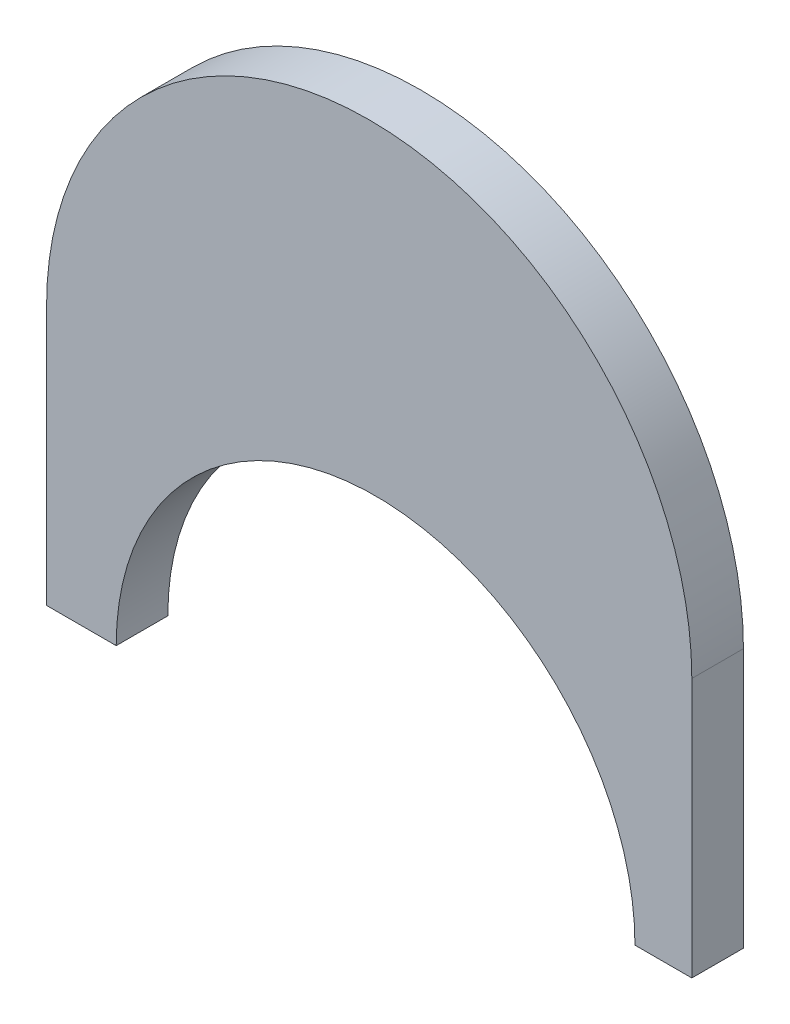
ISO-10303-21;
HEADER;
FILE_DESCRIPTION(('STEP AP214'),'2;1');
FILE_NAME('part.step','',(''),(''),'','','');
FILE_SCHEMA(('AUTOMOTIVE_DESIGN { 1 0 10303 214 1 1 1 1 }'));
ENDSEC;
DATA;
#1=APPLICATION_CONTEXT('core data for automotive mechanical design processes');
#2=APPLICATION_PROTOCOL_DEFINITION('international standard','automotive_design',2000,#1);
#3=PRODUCT_CONTEXT('',#1,'mechanical');
#4=PRODUCT('Part','Part','',(#3));
#5=PRODUCT_RELATED_PRODUCT_CATEGORY('part','',(#4));
#6=PRODUCT_DEFINITION_FORMATION('','',#4);
#7=PRODUCT_DEFINITION_CONTEXT('part definition',#1,'design');
#8=PRODUCT_DEFINITION('design','',#6,#7);
#9=PRODUCT_DEFINITION_SHAPE('','',#8);
#10=(LENGTH_UNIT() NAMED_UNIT(*) SI_UNIT(.MILLI.,.METRE.));
#11=(NAMED_UNIT(*) PLANE_ANGLE_UNIT() SI_UNIT($,.RADIAN.));
#12=(NAMED_UNIT(*) SI_UNIT($,.STERADIAN.) SOLID_ANGLE_UNIT());
#13=UNCERTAINTY_MEASURE_WITH_UNIT(LENGTH_MEASURE(1.E-05),#10,'distance_accuracy_value','');
#14=(GEOMETRIC_REPRESENTATION_CONTEXT(3) GLOBAL_UNCERTAINTY_ASSIGNED_CONTEXT((#13)) GLOBAL_UNIT_ASSIGNED_CONTEXT((#10,
#11,#12)) REPRESENTATION_CONTEXT('',''));
#15=CARTESIAN_POINT('',(0.,0.,0.));
#16=DIRECTION('',(0.,0.,1.));
#17=DIRECTION('',(1.,0.,0.));
#18=AXIS2_PLACEMENT_3D('',#15,#16,#17);
#19=CARTESIAN_POINT('',(0.629745704665386,-25.5192309709257,-5.08));
#20=DIRECTION('',(0.,0.,1.));
#21=DIRECTION('',(1.,0.,0.));
#22=AXIS2_PLACEMENT_3D('',#19,#20,#21);
#23=CYLINDRICAL_SURFACE('',#22,25.527);
#24=CARTESIAN_POINT('',(0.629745704665386,-25.5192309709257,0.));
#25=DIRECTION('',(0.,0.,1.));
#26=DIRECTION('',(1.,0.,0.));
#27=AXIS2_PLACEMENT_3D('',#24,#25,#26);
#28=CIRCLE('',#27,25.527);
#29=CARTESIAN_POINT('',(26.1567457046654,-25.5192309709257,0.));
#30=VERTEX_POINT('',#29);
#31=CARTESIAN_POINT('',(-24.8972542953346,-25.5192309709257,0.));
#32=VERTEX_POINT('',#31);
#33=EDGE_CURVE('E116',#30,#32,#28,.T.);
#34=ORIENTED_EDGE('',*,*,#33,.T.);
#35=DIRECTION('',(0.,0.,1.));
#36=VECTOR('',#35,1.);
#37=CARTESIAN_POINT('',(-24.8972542953346,-25.5192309709257,-5.08));
#38=LINE('',#37,#36);
#39=CARTESIAN_POINT('',(-24.8972542953346,-25.5192309709257,-5.08));
#40=VERTEX_POINT('',#39);
#41=EDGE_CURVE('E11',#40,#32,#38,.T.);
#42=ORIENTED_EDGE('',*,*,#41,.F.);
#43=CARTESIAN_POINT('',(0.629745704665386,-25.5192309709257,-5.08));
#44=DIRECTION('',(0.,0.,1.));
#45=DIRECTION('',(1.,0.,0.));
#46=AXIS2_PLACEMENT_3D('',#43,#44,#45);
#47=CIRCLE('',#46,25.527);
#48=CARTESIAN_POINT('',(26.1567457046654,-25.5192309709257,-5.08));
#49=VERTEX_POINT('',#48);
#50=EDGE_CURVE('E53',#49,#40,#47,.T.);
#51=ORIENTED_EDGE('',*,*,#50,.F.);
#52=DIRECTION('',(0.,0.,1.));
#53=VECTOR('',#52,1.);
#54=CARTESIAN_POINT('',(26.1567457046654,-25.5192309709257,-5.08));
#55=LINE('',#54,#53);
#56=EDGE_CURVE('E38',#49,#30,#55,.T.);
#57=ORIENTED_EDGE('',*,*,#56,.T.);
#58=EDGE_LOOP('',(#34,#42,#51,#57));
#59=FACE_BOUND('',#58,.T.);
#60=ADVANCED_FACE('F35',(#59),#23,.F.);
#61=CARTESIAN_POINT('',(0.,-25.5192309709257,-5.08));
#62=DIRECTION('',(0.,-1.,0.));
#63=DIRECTION('',(0.,0.,-1.));
#64=AXIS2_PLACEMENT_3D('',#61,#62,#63);
#65=PLANE('',#64);
#66=DIRECTION('',(1.,0.,0.));
#67=VECTOR('',#66,1.);
#68=CARTESIAN_POINT('',(0.,-25.5192309709257,0.));
#69=LINE('',#68,#67);
#70=CARTESIAN_POINT('',(-31.7499990494833,-25.5192309709257,0.));
#71=VERTEX_POINT('',#70);
#72=EDGE_CURVE('E125',#71,#32,#69,.T.);
#73=ORIENTED_EDGE('',*,*,#72,.F.);
#74=DIRECTION('',(0.,0.,1.));
#75=VECTOR('',#74,1.);
#76=CARTESIAN_POINT('',(-31.7499990494833,-25.5192309709257,-5.08));
#77=LINE('',#76,#75);
#78=CARTESIAN_POINT('',(-31.7499990494833,-25.5192309709257,-5.08));
#79=VERTEX_POINT('',#78);
#80=EDGE_CURVE('E44',#79,#71,#77,.T.);
#81=ORIENTED_EDGE('',*,*,#80,.F.);
#82=DIRECTION('',(1.,0.,0.));
#83=VECTOR('',#82,1.);
#84=CARTESIAN_POINT('',(0.,-25.5192309709257,-5.08));
#85=LINE('',#84,#83);
#86=EDGE_CURVE('E111',#79,#40,#85,.T.);
#87=ORIENTED_EDGE('',*,*,#86,.T.);
#88=ORIENTED_EDGE('',*,*,#41,.T.);
#89=EDGE_LOOP('',(#73,#81,#87,#88));
#90=FACE_BOUND('',#89,.T.);
#91=ADVANCED_FACE('F140',(#90),#65,.T.);
#92=CARTESIAN_POINT('',(-31.7499990494833,0.,-5.08));
#93=DIRECTION('',(-1.,0.,0.));
#94=DIRECTION('',(0.,0.,1.));
#95=AXIS2_PLACEMENT_3D('',#92,#93,#94);
#96=PLANE('',#95);
#97=DIRECTION('',(0.,-1.,0.));
#98=VECTOR('',#97,1.);
#99=CARTESIAN_POINT('',(-31.7499990494833,0.,0.));
#100=LINE('',#99,#98);
#101=CARTESIAN_POINT('',(-31.7499990494833,0.00776902907425811,0.));
#102=VERTEX_POINT('',#101);
#103=EDGE_CURVE('E98',#102,#71,#100,.T.);
#104=ORIENTED_EDGE('',*,*,#103,.F.);
#105=DIRECTION('',(0.,0.,1.));
#106=VECTOR('',#105,1.);
#107=CARTESIAN_POINT('',(-31.7499990494833,0.00776902907425811,-5.08));
#108=LINE('',#107,#106);
#109=CARTESIAN_POINT('',(-31.7499990494833,0.00776902907425811,-5.08));
#110=VERTEX_POINT('',#109);
#111=EDGE_CURVE('E93',#110,#102,#108,.T.);
#112=ORIENTED_EDGE('',*,*,#111,.F.);
#113=DIRECTION('',(0.,-1.,0.));
#114=VECTOR('',#113,1.);
#115=CARTESIAN_POINT('',(-31.7499990494833,0.,-5.08));
#116=LINE('',#115,#114);
#117=EDGE_CURVE('E97',#110,#79,#116,.T.);
#118=ORIENTED_EDGE('',*,*,#117,.T.);
#119=ORIENTED_EDGE('',*,*,#80,.T.);
#120=EDGE_LOOP('',(#104,#112,#118,#119));
#121=FACE_BOUND('',#120,.T.);
#122=ADVANCED_FACE('F95',(#121),#96,.T.);
#123=CARTESIAN_POINT('',(0.,0.,-5.08));
#124=DIRECTION('',(0.,0.,1.));
#125=DIRECTION('',(1.,0.,0.));
#126=AXIS2_PLACEMENT_3D('',#123,#124,#125);
#127=CYLINDRICAL_SURFACE('',#126,31.75);
#128=CARTESIAN_POINT('',(0.,0.,0.));
#129=DIRECTION('',(0.,0.,1.));
#130=DIRECTION('',(1.,0.,0.));
#131=AXIS2_PLACEMENT_3D('',#128,#129,#130);
#132=CIRCLE('',#131,31.75);
#133=CARTESIAN_POINT('',(31.7499990494833,0.00776902907426589,0.));
#134=VERTEX_POINT('',#133);
#135=EDGE_CURVE('E122',#102,#134,#132,.F.);
#136=ORIENTED_EDGE('',*,*,#135,.T.);
#137=DIRECTION('',(0.,0.,1.));
#138=VECTOR('',#137,1.);
#139=CARTESIAN_POINT('',(31.7499990494833,0.00776902907426589,-5.08));
#140=LINE('',#139,#138);
#141=CARTESIAN_POINT('',(31.7499990494833,0.00776902907426589,-5.08));
#142=VERTEX_POINT('',#141);
#143=EDGE_CURVE('E101',#142,#134,#140,.T.);
#144=ORIENTED_EDGE('',*,*,#143,.F.);
#145=CARTESIAN_POINT('',(0.,0.,-5.08));
#146=DIRECTION('',(0.,0.,1.));
#147=DIRECTION('',(1.,0.,0.));
#148=AXIS2_PLACEMENT_3D('',#145,#146,#147);
#149=CIRCLE('',#148,31.75);
#150=EDGE_CURVE('E104',#110,#142,#149,.F.);
#151=ORIENTED_EDGE('',*,*,#150,.F.);
#152=ORIENTED_EDGE('',*,*,#111,.T.);
#153=EDGE_LOOP('',(#136,#144,#151,#152));
#154=FACE_BOUND('',#153,.T.);
#155=ADVANCED_FACE('F105',(#154),#127,.T.);
#156=CARTESIAN_POINT('',(31.7499990494833,0.,-5.08));
#157=DIRECTION('',(-1.,0.,0.));
#158=DIRECTION('',(0.,0.,1.));
#159=AXIS2_PLACEMENT_3D('',#156,#157,#158);
#160=PLANE('',#159);
#161=DIRECTION('',(0.,-1.,0.));
#162=VECTOR('',#161,1.);
#163=CARTESIAN_POINT('',(31.7499990494833,0.,0.));
#164=LINE('',#163,#162);
#165=CARTESIAN_POINT('',(31.7499990494833,-25.5192309709257,0.));
#166=VERTEX_POINT('',#165);
#167=EDGE_CURVE('E120',#134,#166,#164,.T.);
#168=ORIENTED_EDGE('',*,*,#167,.T.);
#169=DIRECTION('',(0.,0.,1.));
#170=VECTOR('',#169,1.);
#171=CARTESIAN_POINT('',(31.7499990494833,-25.5192309709257,-5.08));
#172=LINE('',#171,#170);
#173=CARTESIAN_POINT('',(31.7499990494833,-25.5192309709257,-5.08));
#174=VERTEX_POINT('',#173);
#175=EDGE_CURVE('E129',#174,#166,#172,.T.);
#176=ORIENTED_EDGE('',*,*,#175,.F.);
#177=DIRECTION('',(0.,-1.,0.));
#178=VECTOR('',#177,1.);
#179=CARTESIAN_POINT('',(31.7499990494833,0.,-5.08));
#180=LINE('',#179,#178);
#181=EDGE_CURVE('E108',#142,#174,#180,.T.);
#182=ORIENTED_EDGE('',*,*,#181,.F.);
#183=ORIENTED_EDGE('',*,*,#143,.T.);
#184=EDGE_LOOP('',(#168,#176,#182,#183));
#185=FACE_BOUND('',#184,.T.);
#186=ADVANCED_FACE('F153',(#185),#160,.F.);
#187=CARTESIAN_POINT('',(0.,-25.5192309709257,-5.08));
#188=DIRECTION('',(0.,1.,0.));
#189=DIRECTION('',(0.,0.,1.));
#190=AXIS2_PLACEMENT_3D('',#187,#188,#189);
#191=PLANE('',#190);
#192=DIRECTION('',(-1.,0.,0.));
#193=VECTOR('',#192,1.);
#194=CARTESIAN_POINT('',(0.,-25.5192309709257,0.));
#195=LINE('',#194,#193);
#196=EDGE_CURVE('E118',#166,#30,#195,.T.);
#197=ORIENTED_EDGE('',*,*,#196,.T.);
#198=ORIENTED_EDGE('',*,*,#56,.F.);
#199=DIRECTION('',(-1.,0.,0.));
#200=VECTOR('',#199,1.);
#201=CARTESIAN_POINT('',(0.,-25.5192309709257,-5.08));
#202=LINE('',#201,#200);
#203=EDGE_CURVE('E86',#174,#49,#202,.T.);
#204=ORIENTED_EDGE('',*,*,#203,.F.);
#205=ORIENTED_EDGE('',*,*,#175,.T.);
#206=EDGE_LOOP('',(#197,#198,#204,#205));
#207=FACE_BOUND('',#206,.T.);
#208=ADVANCED_FACE('F155',(#207),#191,.F.);
#209=CARTESIAN_POINT('',(0.,0.,-5.08));
#210=DIRECTION('',(0.,0.,1.));
#211=DIRECTION('',(1.,0.,0.));
#212=AXIS2_PLACEMENT_3D('',#209,#210,#211);
#213=PLANE('',#212);
#214=ORIENTED_EDGE('',*,*,#50,.T.);
#215=ORIENTED_EDGE('',*,*,#86,.F.);
#216=ORIENTED_EDGE('',*,*,#117,.F.);
#217=ORIENTED_EDGE('',*,*,#150,.T.);
#218=ORIENTED_EDGE('',*,*,#181,.T.);
#219=ORIENTED_EDGE('',*,*,#203,.T.);
#220=EDGE_LOOP('',(#214,#215,#216,#217,#218,#219));
#221=FACE_BOUND('',#220,.T.);
#222=ADVANCED_FACE('F110',(#221),#213,.F.);
#223=CARTESIAN_POINT('',(0.,0.,0.));
#224=DIRECTION('',(0.,0.,1.));
#225=DIRECTION('',(1.,0.,0.));
#226=AXIS2_PLACEMENT_3D('',#223,#224,#225);
#227=PLANE('',#226);
#228=ORIENTED_EDGE('',*,*,#33,.F.);
#229=ORIENTED_EDGE('',*,*,#196,.F.);
#230=ORIENTED_EDGE('',*,*,#167,.F.);
#231=ORIENTED_EDGE('',*,*,#135,.F.);
#232=ORIENTED_EDGE('',*,*,#103,.T.);
#233=ORIENTED_EDGE('',*,*,#72,.T.);
#234=EDGE_LOOP('',(#228,#229,#230,#231,#232,#233));
#235=FACE_BOUND('',#234,.T.);
#236=ADVANCED_FACE('F138',(#235),#227,.T.);
#237=CLOSED_SHELL('',(#60,#91,#122,#155,#186,#208,#222,#236));
#238=MANIFOLD_SOLID_BREP('B2',#237);
#239=ADVANCED_BREP_SHAPE_REPRESENTATION('',(#18,#238),#14);
#240=SHAPE_DEFINITION_REPRESENTATION(#9,#239);
ENDSEC;
END-ISO-10303-21;
